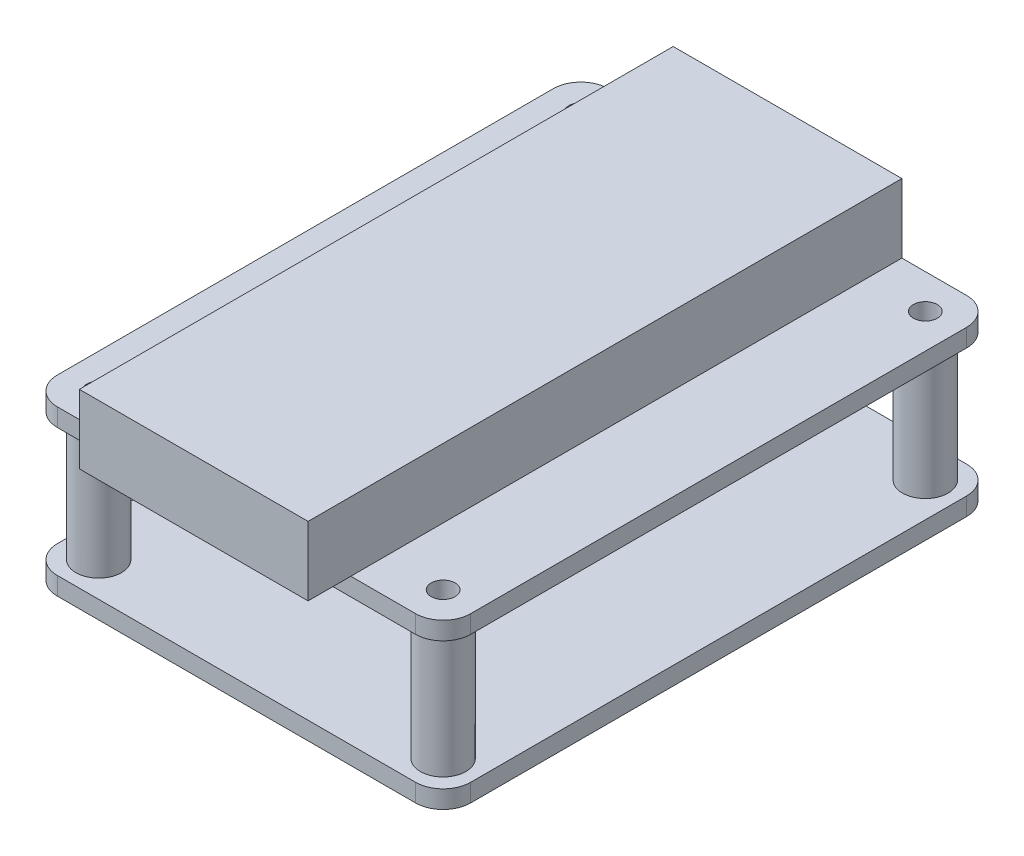
ISO-10303-21;
HEADER;
FILE_DESCRIPTION(('STEP AP214'),'2;1');
FILE_NAME('part.step','',(''),(''),'','','');
FILE_SCHEMA(('AUTOMOTIVE_DESIGN { 1 0 10303 214 1 1 1 1 }'));
ENDSEC;
DATA;
#1=APPLICATION_CONTEXT('core data for automotive mechanical design processes');
#2=APPLICATION_PROTOCOL_DEFINITION('international standard','automotive_design',2000,#1);
#3=PRODUCT_CONTEXT('',#1,'mechanical');
#4=PRODUCT('Part','Part','',(#3));
#5=PRODUCT_RELATED_PRODUCT_CATEGORY('part','',(#4));
#6=PRODUCT_DEFINITION_FORMATION('','',#4);
#7=PRODUCT_DEFINITION_CONTEXT('part definition',#1,'design');
#8=PRODUCT_DEFINITION('design','',#6,#7);
#9=PRODUCT_DEFINITION_SHAPE('','',#8);
#10=(LENGTH_UNIT() NAMED_UNIT(*) SI_UNIT(.MILLI.,.METRE.));
#11=(NAMED_UNIT(*) PLANE_ANGLE_UNIT() SI_UNIT($,.RADIAN.));
#12=(NAMED_UNIT(*) SI_UNIT($,.STERADIAN.) SOLID_ANGLE_UNIT());
#13=UNCERTAINTY_MEASURE_WITH_UNIT(LENGTH_MEASURE(1.E-05),#10,'distance_accuracy_value','');
#14=(GEOMETRIC_REPRESENTATION_CONTEXT(3) GLOBAL_UNCERTAINTY_ASSIGNED_CONTEXT((#13)) GLOBAL_UNIT_ASSIGNED_CONTEXT((#10,
#11,#12)) REPRESENTATION_CONTEXT('',''));
#15=CARTESIAN_POINT('',(0.,0.,0.));
#16=DIRECTION('',(0.,0.,1.));
#17=DIRECTION('',(1.,0.,0.));
#18=AXIS2_PLACEMENT_3D('',#15,#16,#17);
#19=CARTESIAN_POINT('',(-0.635000000000002,15.113,0.635000000000001));
#20=DIRECTION('',(0.,-1.,0.));
#21=DIRECTION('',(0.,0.,-1.));
#22=AXIS2_PLACEMENT_3D('',#19,#20,#21);
#23=PLANE('',#22);
#24=CARTESIAN_POINT('',(0.,15.113,0.));
#25=DIRECTION('',(0.,-1.,0.));
#26=DIRECTION('',(0.,0.,-1.));
#27=AXIS2_PLACEMENT_3D('',#24,#25,#26);
#28=CIRCLE('',#27,1.1);
#29=CARTESIAN_POINT('',(0.,15.113,-1.1));
#30=VERTEX_POINT('',#29);
#31=EDGE_CURVE('E232',#30,#30,#28,.T.);
#32=ORIENTED_EDGE('',*,*,#31,.T.);
#33=EDGE_LOOP('',(#32));
#34=FACE_BOUND('',#33,.T.);
#35=CARTESIAN_POINT('',(0.,15.113,-44.45));
#36=DIRECTION('',(0.,-1.,0.));
#37=DIRECTION('',(0.,0.,-1.));
#38=AXIS2_PLACEMENT_3D('',#35,#36,#37);
#39=CIRCLE('',#38,1.1);
#40=CARTESIAN_POINT('',(0.,15.113,-45.55));
#41=VERTEX_POINT('',#40);
#42=EDGE_CURVE('E238',#41,#41,#39,.T.);
#43=ORIENTED_EDGE('',*,*,#42,.T.);
#44=EDGE_LOOP('',(#43));
#45=FACE_BOUND('',#44,.T.);
#46=DIRECTION('',(0.,0.,1.));
#47=VECTOR('',#46,1.);
#48=CARTESIAN_POINT('',(5.334,15.113,-47.625));
#49=LINE('',#48,#47);
#50=CARTESIAN_POINT('',(5.334,15.113,-47.625));
#51=VERTEX_POINT('',#50);
#52=CARTESIAN_POINT('',(5.334,15.113,3.175));
#53=VERTEX_POINT('',#52);
#54=EDGE_CURVE('E66',#51,#53,#49,.T.);
#55=ORIENTED_EDGE('',*,*,#54,.F.);
#56=DIRECTION('',(1.,0.,0.));
#57=VECTOR('',#56,1.);
#58=CARTESIAN_POINT('',(-0.635000000000014,15.113,-47.625));
#59=LINE('',#58,#57);
#60=CARTESIAN_POINT('',(-0.635000000000014,15.113,-47.625));
#61=VERTEX_POINT('',#60);
#62=EDGE_CURVE('E271',#61,#51,#59,.T.);
#63=ORIENTED_EDGE('',*,*,#62,.F.);
#64=CARTESIAN_POINT('',(-0.635000000000013,15.113,-45.085));
#65=DIRECTION('',(0.,-1.,0.));
#66=DIRECTION('',(0.,0.,-1.));
#67=AXIS2_PLACEMENT_3D('',#64,#65,#66);
#68=CIRCLE('',#67,2.54);
#69=CARTESIAN_POINT('',(-3.17500000000001,15.113,-45.085));
#70=VERTEX_POINT('',#69);
#71=EDGE_CURVE('E268',#70,#61,#68,.T.);
#72=ORIENTED_EDGE('',*,*,#71,.F.);
#73=DIRECTION('',(0.,0.,-1.));
#74=VECTOR('',#73,1.);
#75=CARTESIAN_POINT('',(-3.175,15.113,0.635000000000001));
#76=LINE('',#75,#74);
#77=CARTESIAN_POINT('',(-3.175,15.113,0.635000000000001));
#78=VERTEX_POINT('',#77);
#79=EDGE_CURVE('E266',#78,#70,#76,.T.);
#80=ORIENTED_EDGE('',*,*,#79,.F.);
#81=CARTESIAN_POINT('',(-0.635000000000002,15.113,0.635000000000001));
#82=DIRECTION('',(0.,-1.,0.));
#83=DIRECTION('',(0.,0.,-1.));
#84=AXIS2_PLACEMENT_3D('',#81,#82,#83);
#85=CIRCLE('',#84,2.54);
#86=CARTESIAN_POINT('',(-0.635000000000002,15.113,3.175));
#87=VERTEX_POINT('',#86);
#88=EDGE_CURVE('E244',#87,#78,#85,.T.);
#89=ORIENTED_EDGE('',*,*,#88,.F.);
#90=DIRECTION('',(-1.,0.,0.));
#91=VECTOR('',#90,1.);
#92=CARTESIAN_POINT('',(32.385,15.113,3.17499999999998));
#93=LINE('',#92,#91);
#94=EDGE_CURVE('E71',#53,#87,#93,.T.);
#95=ORIENTED_EDGE('',*,*,#94,.F.);
#96=EDGE_LOOP('',(#55,#63,#72,#80,#89,#95));
#97=FACE_BOUND('',#96,.T.);
#98=ADVANCED_FACE('F49',(#34,#45,#97),#23,.F.);
#99=CARTESIAN_POINT('',(31.75,15.113,0.));
#100=DIRECTION('',(0.,-1.,0.));
#101=DIRECTION('',(0.,0.,-1.));
#102=AXIS2_PLACEMENT_3D('',#99,#100,#101);
#103=CIRCLE('',#102,1.1);
#104=CARTESIAN_POINT('',(31.75,15.113,-1.1));
#105=VERTEX_POINT('',#104);
#106=EDGE_CURVE('E235',#105,#105,#103,.T.);
#107=ORIENTED_EDGE('',*,*,#106,.T.);
#108=EDGE_LOOP('',(#107));
#109=FACE_BOUND('',#108,.T.);
#110=CARTESIAN_POINT('',(31.75,15.113,-44.45));
#111=DIRECTION('',(0.,-1.,0.));
#112=DIRECTION('',(0.,0.,-1.));
#113=AXIS2_PLACEMENT_3D('',#110,#111,#112);
#114=CIRCLE('',#113,1.09999999999999);
#115=CARTESIAN_POINT('',(31.75,15.113,-45.55));
#116=VERTEX_POINT('',#115);
#117=EDGE_CURVE('E241',#116,#116,#114,.T.);
#118=ORIENTED_EDGE('',*,*,#117,.T.);
#119=EDGE_LOOP('',(#118));
#120=FACE_BOUND('',#119,.T.);
#121=DIRECTION('',(0.,0.,-1.));
#122=VECTOR('',#121,1.);
#123=CARTESIAN_POINT('',(26.416,15.113,-47.625));
#124=LINE('',#123,#122);
#125=CARTESIAN_POINT('',(26.416,15.113,3.17499999999998));
#126=VERTEX_POINT('',#125);
#127=CARTESIAN_POINT('',(26.416,15.113,-47.625));
#128=VERTEX_POINT('',#127);
#129=EDGE_CURVE('E11',#126,#128,#124,.T.);
#130=ORIENTED_EDGE('',*,*,#129,.F.);
#131=CARTESIAN_POINT('',(32.385,15.113,3.17499999999998));
#132=VERTEX_POINT('',#131);
#133=EDGE_CURVE('E249',#132,#126,#93,.T.);
#134=ORIENTED_EDGE('',*,*,#133,.F.);
#135=CARTESIAN_POINT('',(32.385,15.113,0.634999999999983));
#136=DIRECTION('',(0.,-1.,0.));
#137=DIRECTION('',(0.,0.,-1.));
#138=AXIS2_PLACEMENT_3D('',#135,#136,#137);
#139=CIRCLE('',#138,2.53999999999999);
#140=CARTESIAN_POINT('',(34.925,15.113,0.635000000000002));
#141=VERTEX_POINT('',#140);
#142=EDGE_CURVE('E277',#141,#132,#139,.T.);
#143=ORIENTED_EDGE('',*,*,#142,.F.);
#144=DIRECTION('',(0.,0.,1.));
#145=VECTOR('',#144,1.);
#146=CARTESIAN_POINT('',(34.925,15.113,-45.085));
#147=LINE('',#146,#145);
#148=CARTESIAN_POINT('',(34.925,15.113,-45.085));
#149=VERTEX_POINT('',#148);
#150=EDGE_CURVE('E275',#149,#141,#147,.T.);
#151=ORIENTED_EDGE('',*,*,#150,.F.);
#152=CARTESIAN_POINT('',(32.385,15.113,-45.085));
#153=DIRECTION('',(0.,-1.,0.));
#154=DIRECTION('',(0.,0.,-1.));
#155=AXIS2_PLACEMENT_3D('',#152,#153,#154);
#156=CIRCLE('',#155,2.53999999999999);
#157=CARTESIAN_POINT('',(32.385,15.113,-47.625));
#158=VERTEX_POINT('',#157);
#159=EDGE_CURVE('E273',#158,#149,#156,.T.);
#160=ORIENTED_EDGE('',*,*,#159,.F.);
#161=EDGE_CURVE('E270',#128,#158,#59,.T.);
#162=ORIENTED_EDGE('',*,*,#161,.F.);
#163=EDGE_LOOP('',(#130,#134,#143,#151,#160,#162));
#164=FACE_BOUND('',#163,.T.);
#165=ADVANCED_FACE('F395',(#109,#120,#164),#23,.F.);
#166=CARTESIAN_POINT('',(-0.635000000000002,1.651,0.635000000000001));
#167=DIRECTION('',(0.,-1.,0.));
#168=DIRECTION('',(0.,0.,-1.));
#169=AXIS2_PLACEMENT_3D('',#166,#167,#168);
#170=PLANE('',#169);
#171=CARTESIAN_POINT('',(31.75,1.651,-44.45));
#172=DIRECTION('',(0.,-1.,0.));
#173=DIRECTION('',(0.,0.,-1.));
#174=AXIS2_PLACEMENT_3D('',#171,#172,#173);
#175=CIRCLE('',#174,2.1);
#176=CARTESIAN_POINT('',(31.75,1.651,-46.55));
#177=VERTEX_POINT('',#176);
#178=EDGE_CURVE('E383',#177,#177,#175,.F.);
#179=ORIENTED_EDGE('',*,*,#178,.F.);
#180=EDGE_LOOP('',(#179));
#181=FACE_BOUND('',#180,.T.);
#182=CARTESIAN_POINT('',(-0.635000000000002,1.651,0.635000000000001));
#183=DIRECTION('',(0.,1.,0.));
#184=DIRECTION('',(0.,0.,-1.));
#185=AXIS2_PLACEMENT_3D('',#182,#183,#184);
#186=CIRCLE('',#185,2.54);
#187=CARTESIAN_POINT('',(-3.175,1.651,0.635000000000001));
#188=VERTEX_POINT('',#187);
#189=CARTESIAN_POINT('',(-0.635000000000002,1.651,3.175));
#190=VERTEX_POINT('',#189);
#191=EDGE_CURVE('E326',#188,#190,#186,.T.);
#192=ORIENTED_EDGE('',*,*,#191,.T.);
#193=DIRECTION('',(1.,0.,0.));
#194=VECTOR('',#193,1.);
#195=CARTESIAN_POINT('',(-0.635000000000002,1.651,3.175));
#196=LINE('',#195,#194);
#197=CARTESIAN_POINT('',(32.385,1.651,3.17499999999998));
#198=VERTEX_POINT('',#197);
#199=EDGE_CURVE('E329',#190,#198,#196,.T.);
#200=ORIENTED_EDGE('',*,*,#199,.T.);
#201=CARTESIAN_POINT('',(32.385,1.651,0.634999999999983));
#202=DIRECTION('',(0.,1.,0.));
#203=DIRECTION('',(0.,0.,1.));
#204=AXIS2_PLACEMENT_3D('',#201,#202,#203);
#205=CIRCLE('',#204,2.53999999999999);
#206=CARTESIAN_POINT('',(34.925,1.651,0.635000000000002));
#207=VERTEX_POINT('',#206);
#208=EDGE_CURVE('E332',#198,#207,#205,.T.);
#209=ORIENTED_EDGE('',*,*,#208,.T.);
#210=DIRECTION('',(0.,0.,-1.));
#211=VECTOR('',#210,1.);
#212=CARTESIAN_POINT('',(34.925,1.651,0.635000000000001));
#213=LINE('',#212,#211);
#214=CARTESIAN_POINT('',(34.925,1.651,-45.085));
#215=VERTEX_POINT('',#214);
#216=EDGE_CURVE('E334',#207,#215,#213,.T.);
#217=ORIENTED_EDGE('',*,*,#216,.T.);
#218=CARTESIAN_POINT('',(32.385,1.651,-45.085));
#219=DIRECTION('',(0.,1.,0.));
#220=DIRECTION('',(0.,0.,-1.));
#221=AXIS2_PLACEMENT_3D('',#218,#219,#220);
#222=CIRCLE('',#221,2.54);
#223=CARTESIAN_POINT('',(32.385,1.651,-47.625));
#224=VERTEX_POINT('',#223);
#225=EDGE_CURVE('E336',#215,#224,#222,.T.);
#226=ORIENTED_EDGE('',*,*,#225,.T.);
#227=DIRECTION('',(-1.,0.,0.));
#228=VECTOR('',#227,1.);
#229=CARTESIAN_POINT('',(-0.635000000000014,1.651,-47.625));
#230=LINE('',#229,#228);
#231=CARTESIAN_POINT('',(-0.635000000000014,1.651,-47.625));
#232=VERTEX_POINT('',#231);
#233=EDGE_CURVE('E338',#224,#232,#230,.T.);
#234=ORIENTED_EDGE('',*,*,#233,.T.);
#235=CARTESIAN_POINT('',(-0.635000000000013,1.651,-45.085));
#236=DIRECTION('',(0.,1.,0.));
#237=DIRECTION('',(0.,0.,-1.));
#238=AXIS2_PLACEMENT_3D('',#235,#236,#237);
#239=CIRCLE('',#238,2.54);
#240=CARTESIAN_POINT('',(-3.17500000000001,1.651,-45.085));
#241=VERTEX_POINT('',#240);
#242=EDGE_CURVE('E340',#232,#241,#239,.T.);
#243=ORIENTED_EDGE('',*,*,#242,.T.);
#244=DIRECTION('',(0.,0.,1.));
#245=VECTOR('',#244,1.);
#246=CARTESIAN_POINT('',(-3.175,1.651,0.635000000000001));
#247=LINE('',#246,#245);
#248=EDGE_CURVE('E342',#241,#188,#247,.T.);
#249=ORIENTED_EDGE('',*,*,#248,.T.);
#250=EDGE_LOOP('',(#192,#200,#209,#217,#226,#234,#243,#249));
#251=FACE_BOUND('',#250,.T.);
#252=CARTESIAN_POINT('',(0.,1.651,0.));
#253=DIRECTION('',(0.,1.,0.));
#254=DIRECTION('',(0.,0.,1.));
#255=AXIS2_PLACEMENT_3D('',#252,#253,#254);
#256=CIRCLE('',#255,2.1);
#257=CARTESIAN_POINT('',(0.,1.651,2.1));
#258=VERTEX_POINT('',#257);
#259=EDGE_CURVE('E306',#258,#258,#256,.T.);
#260=ORIENTED_EDGE('',*,*,#259,.F.);
#261=EDGE_LOOP('',(#260));
#262=FACE_BOUND('',#261,.T.);
#263=CARTESIAN_POINT('',(31.75,1.651,0.));
#264=DIRECTION('',(0.,-1.,0.));
#265=DIRECTION('',(0.,0.,-1.));
#266=AXIS2_PLACEMENT_3D('',#263,#264,#265);
#267=CIRCLE('',#266,2.1);
#268=CARTESIAN_POINT('',(31.75,1.651,-2.1));
#269=VERTEX_POINT('',#268);
#270=EDGE_CURVE('E309',#269,#269,#267,.F.);
#271=ORIENTED_EDGE('',*,*,#270,.F.);
#272=EDGE_LOOP('',(#271));
#273=FACE_BOUND('',#272,.T.);
#274=CARTESIAN_POINT('',(0.,1.651,-44.45));
#275=DIRECTION('',(0.,-1.,0.));
#276=DIRECTION('',(0.,0.,-1.));
#277=AXIS2_PLACEMENT_3D('',#274,#275,#276);
#278=CIRCLE('',#277,2.1);
#279=CARTESIAN_POINT('',(0.,1.651,-46.55));
#280=VERTEX_POINT('',#279);
#281=EDGE_CURVE('E53',#280,#280,#278,.F.);
#282=ORIENTED_EDGE('',*,*,#281,.F.);
#283=EDGE_LOOP('',(#282));
#284=FACE_BOUND('',#283,.T.);
#285=ADVANCED_FACE('F392',(#181,#251,#262,#273,#284),#170,.F.);
#286=CARTESIAN_POINT('',(-0.635000000000002,13.462,0.635000000000001));
#287=DIRECTION('',(0.,-1.,0.));
#288=DIRECTION('',(0.,0.,-1.));
#289=AXIS2_PLACEMENT_3D('',#286,#287,#288);
#290=PLANE('',#289);
#291=CARTESIAN_POINT('',(31.75,13.462,-44.45));
#292=DIRECTION('',(0.,-1.,0.));
#293=DIRECTION('',(0.,0.,-1.));
#294=AXIS2_PLACEMENT_3D('',#291,#292,#293);
#295=CIRCLE('',#294,2.1);
#296=CARTESIAN_POINT('',(31.75,13.462,-46.55));
#297=VERTEX_POINT('',#296);
#298=EDGE_CURVE('E221',#297,#297,#295,.T.);
#299=ORIENTED_EDGE('',*,*,#298,.F.);
#300=EDGE_LOOP('',(#299));
#301=FACE_BOUND('',#300,.T.);
#302=CARTESIAN_POINT('',(-0.635000000000002,13.462,0.635000000000001));
#303=DIRECTION('',(0.,-1.,0.));
#304=DIRECTION('',(0.,0.,-1.));
#305=AXIS2_PLACEMENT_3D('',#302,#303,#304);
#306=CIRCLE('',#305,2.54);
#307=CARTESIAN_POINT('',(-0.635000000000002,13.462,3.175));
#308=VERTEX_POINT('',#307);
#309=CARTESIAN_POINT('',(-3.175,13.462,0.635000000000001));
#310=VERTEX_POINT('',#309);
#311=EDGE_CURVE('E245',#308,#310,#306,.T.);
#312=ORIENTED_EDGE('',*,*,#311,.T.);
#313=DIRECTION('',(0.,0.,-1.));
#314=VECTOR('',#313,1.);
#315=CARTESIAN_POINT('',(-3.175,13.462,0.635000000000001));
#316=LINE('',#315,#314);
#317=CARTESIAN_POINT('',(-3.17500000000001,13.462,-45.085));
#318=VERTEX_POINT('',#317);
#319=EDGE_CURVE('E248',#310,#318,#316,.T.);
#320=ORIENTED_EDGE('',*,*,#319,.T.);
#321=CARTESIAN_POINT('',(-0.635000000000013,13.462,-45.085));
#322=DIRECTION('',(0.,-1.,0.));
#323=DIRECTION('',(0.,0.,-1.));
#324=AXIS2_PLACEMENT_3D('',#321,#322,#323);
#325=CIRCLE('',#324,2.54);
#326=CARTESIAN_POINT('',(-0.635000000000014,13.462,-47.625));
#327=VERTEX_POINT('',#326);
#328=EDGE_CURVE('E251',#318,#327,#325,.T.);
#329=ORIENTED_EDGE('',*,*,#328,.T.);
#330=DIRECTION('',(1.,0.,0.));
#331=VECTOR('',#330,1.);
#332=CARTESIAN_POINT('',(-0.635000000000014,13.462,-47.625));
#333=LINE('',#332,#331);
#334=CARTESIAN_POINT('',(32.385,13.462,-47.625));
#335=VERTEX_POINT('',#334);
#336=EDGE_CURVE('E253',#327,#335,#333,.T.);
#337=ORIENTED_EDGE('',*,*,#336,.T.);
#338=CARTESIAN_POINT('',(32.385,13.462,-45.085));
#339=DIRECTION('',(0.,-1.,0.));
#340=DIRECTION('',(0.,0.,-1.));
#341=AXIS2_PLACEMENT_3D('',#338,#339,#340);
#342=CIRCLE('',#341,2.53999999999999);
#343=CARTESIAN_POINT('',(34.925,13.462,-45.085));
#344=VERTEX_POINT('',#343);
#345=EDGE_CURVE('E255',#335,#344,#342,.T.);
#346=ORIENTED_EDGE('',*,*,#345,.T.);
#347=DIRECTION('',(0.,0.,1.));
#348=VECTOR('',#347,1.);
#349=CARTESIAN_POINT('',(34.925,13.462,-45.085));
#350=LINE('',#349,#348);
#351=CARTESIAN_POINT('',(34.925,13.462,0.635000000000002));
#352=VERTEX_POINT('',#351);
#353=EDGE_CURVE('E257',#344,#352,#350,.T.);
#354=ORIENTED_EDGE('',*,*,#353,.T.);
#355=CARTESIAN_POINT('',(32.385,13.462,0.634999999999983));
#356=DIRECTION('',(0.,-1.,0.));
#357=DIRECTION('',(0.,0.,-1.));
#358=AXIS2_PLACEMENT_3D('',#355,#356,#357);
#359=CIRCLE('',#358,2.53999999999999);
#360=CARTESIAN_POINT('',(32.385,13.462,3.17499999999998));
#361=VERTEX_POINT('',#360);
#362=EDGE_CURVE('E259',#352,#361,#359,.T.);
#363=ORIENTED_EDGE('',*,*,#362,.T.);
#364=DIRECTION('',(-1.,0.,0.));
#365=VECTOR('',#364,1.);
#366=CARTESIAN_POINT('',(32.385,13.462,3.17499999999998));
#367=LINE('',#366,#365);
#368=EDGE_CURVE('E261',#361,#308,#367,.T.);
#369=ORIENTED_EDGE('',*,*,#368,.T.);
#370=EDGE_LOOP('',(#312,#320,#329,#337,#346,#354,#363,#369));
#371=FACE_BOUND('',#370,.T.);
#372=CARTESIAN_POINT('',(0.,13.462,0.));
#373=DIRECTION('',(0.,-1.,0.));
#374=DIRECTION('',(0.,0.,-1.));
#375=AXIS2_PLACEMENT_3D('',#372,#373,#374);
#376=CIRCLE('',#375,2.1);
#377=CARTESIAN_POINT('',(0.,13.462,-2.1));
#378=VERTEX_POINT('',#377);
#379=EDGE_CURVE('E305',#378,#378,#376,.T.);
#380=ORIENTED_EDGE('',*,*,#379,.F.);
#381=EDGE_LOOP('',(#380));
#382=FACE_BOUND('',#381,.T.);
#383=CARTESIAN_POINT('',(31.75,13.462,0.));
#384=DIRECTION('',(0.,-1.,0.));
#385=DIRECTION('',(0.,0.,-1.));
#386=AXIS2_PLACEMENT_3D('',#383,#384,#385);
#387=CIRCLE('',#386,2.1);
#388=CARTESIAN_POINT('',(31.75,13.462,-2.1));
#389=VERTEX_POINT('',#388);
#390=EDGE_CURVE('E229',#389,#389,#387,.T.);
#391=ORIENTED_EDGE('',*,*,#390,.F.);
#392=EDGE_LOOP('',(#391));
#393=FACE_BOUND('',#392,.T.);
#394=CARTESIAN_POINT('',(0.,13.462,-44.45));
#395=DIRECTION('',(0.,-1.,0.));
#396=DIRECTION('',(0.,0.,-1.));
#397=AXIS2_PLACEMENT_3D('',#394,#395,#396);
#398=CIRCLE('',#397,2.1);
#399=CARTESIAN_POINT('',(0.,13.462,-46.55));
#400=VERTEX_POINT('',#399);
#401=EDGE_CURVE('E218',#400,#400,#398,.T.);
#402=ORIENTED_EDGE('',*,*,#401,.F.);
#403=EDGE_LOOP('',(#402));
#404=FACE_BOUND('',#403,.T.);
#405=ADVANCED_FACE('F394',(#301,#371,#382,#393,#404),#290,.T.);
#406=CARTESIAN_POINT('',(-0.635000000000002,0.,0.635000000000001));
#407=DIRECTION('',(0.,-1.,0.));
#408=DIRECTION('',(0.,0.,-1.));
#409=AXIS2_PLACEMENT_3D('',#406,#407,#408);
#410=PLANE('',#409);
#411=CARTESIAN_POINT('',(31.75,0.,0.));
#412=DIRECTION('',(0.,1.,0.));
#413=DIRECTION('',(0.,0.,1.));
#414=AXIS2_PLACEMENT_3D('',#411,#412,#413);
#415=CIRCLE('',#414,1.1);
#416=CARTESIAN_POINT('',(31.75,0.,1.1));
#417=VERTEX_POINT('',#416);
#418=EDGE_CURVE('E316',#417,#417,#415,.T.);
#419=ORIENTED_EDGE('',*,*,#418,.T.);
#420=EDGE_LOOP('',(#419));
#421=FACE_BOUND('',#420,.T.);
#422=CARTESIAN_POINT('',(31.75,0.,-44.45));
#423=DIRECTION('',(0.,1.,0.));
#424=DIRECTION('',(0.,0.,1.));
#425=AXIS2_PLACEMENT_3D('',#422,#423,#424);
#426=CIRCLE('',#425,1.1);
#427=CARTESIAN_POINT('',(31.75,0.,-43.35));
#428=VERTEX_POINT('',#427);
#429=EDGE_CURVE('E322',#428,#428,#426,.T.);
#430=ORIENTED_EDGE('',*,*,#429,.T.);
#431=EDGE_LOOP('',(#430));
#432=FACE_BOUND('',#431,.T.);
#433=CARTESIAN_POINT('',(-0.635000000000002,0.,0.635000000000001));
#434=DIRECTION('',(0.,1.,0.));
#435=DIRECTION('',(0.,0.,-1.));
#436=AXIS2_PLACEMENT_3D('',#433,#434,#435);
#437=CIRCLE('',#436,2.54);
#438=CARTESIAN_POINT('',(-3.175,0.,0.635000000000001));
#439=VERTEX_POINT('',#438);
#440=CARTESIAN_POINT('',(-0.635000000000002,0.,3.175));
#441=VERTEX_POINT('',#440);
#442=EDGE_CURVE('E325',#439,#441,#437,.T.);
#443=ORIENTED_EDGE('',*,*,#442,.F.);
#444=DIRECTION('',(0.,0.,1.));
#445=VECTOR('',#444,1.);
#446=CARTESIAN_POINT('',(-3.175,0.,0.635000000000001));
#447=LINE('',#446,#445);
#448=CARTESIAN_POINT('',(-3.17500000000001,0.,-45.085));
#449=VERTEX_POINT('',#448);
#450=EDGE_CURVE('E330',#449,#439,#447,.T.);
#451=ORIENTED_EDGE('',*,*,#450,.F.);
#452=CARTESIAN_POINT('',(-0.635000000000013,0.,-45.085));
#453=DIRECTION('',(0.,1.,0.));
#454=DIRECTION('',(0.,0.,-1.));
#455=AXIS2_PLACEMENT_3D('',#452,#453,#454);
#456=CIRCLE('',#455,2.54);
#457=CARTESIAN_POINT('',(-0.635000000000014,0.,-47.625));
#458=VERTEX_POINT('',#457);
#459=EDGE_CURVE('E357',#458,#449,#456,.T.);
#460=ORIENTED_EDGE('',*,*,#459,.F.);
#461=DIRECTION('',(-1.,0.,0.));
#462=VECTOR('',#461,1.);
#463=CARTESIAN_POINT('',(-0.635000000000014,0.,-47.625));
#464=LINE('',#463,#462);
#465=CARTESIAN_POINT('',(32.385,0.,-47.625));
#466=VERTEX_POINT('',#465);
#467=EDGE_CURVE('E355',#466,#458,#464,.T.);
#468=ORIENTED_EDGE('',*,*,#467,.F.);
#469=CARTESIAN_POINT('',(32.385,0.,-45.085));
#470=DIRECTION('',(0.,1.,0.));
#471=DIRECTION('',(0.,0.,-1.));
#472=AXIS2_PLACEMENT_3D('',#469,#470,#471);
#473=CIRCLE('',#472,2.54);
#474=CARTESIAN_POINT('',(34.925,0.,-45.085));
#475=VERTEX_POINT('',#474);
#476=EDGE_CURVE('E353',#475,#466,#473,.T.);
#477=ORIENTED_EDGE('',*,*,#476,.F.);
#478=DIRECTION('',(0.,0.,-1.));
#479=VECTOR('',#478,1.);
#480=CARTESIAN_POINT('',(34.925,0.,0.635000000000001));
#481=LINE('',#480,#479);
#482=CARTESIAN_POINT('',(34.925,0.,0.635000000000002));
#483=VERTEX_POINT('',#482);
#484=EDGE_CURVE('E351',#483,#475,#481,.T.);
#485=ORIENTED_EDGE('',*,*,#484,.F.);
#486=CARTESIAN_POINT('',(32.385,0.,0.634999999999983));
#487=DIRECTION('',(0.,1.,0.));
#488=DIRECTION('',(0.,0.,1.));
#489=AXIS2_PLACEMENT_3D('',#486,#487,#488);
#490=CIRCLE('',#489,2.53999999999999);
#491=CARTESIAN_POINT('',(32.385,0.,3.17499999999998));
#492=VERTEX_POINT('',#491);
#493=EDGE_CURVE('E349',#492,#483,#490,.T.);
#494=ORIENTED_EDGE('',*,*,#493,.F.);
#495=DIRECTION('',(1.,0.,0.));
#496=VECTOR('',#495,1.);
#497=CARTESIAN_POINT('',(-0.635000000000002,0.,3.175));
#498=LINE('',#497,#496);
#499=EDGE_CURVE('E347',#441,#492,#498,.T.);
#500=ORIENTED_EDGE('',*,*,#499,.F.);
#501=EDGE_LOOP('',(#443,#451,#460,#468,#477,#485,#494,#500));
#502=FACE_BOUND('',#501,.T.);
#503=CARTESIAN_POINT('',(0.,0.,-44.45));
#504=DIRECTION('',(0.,1.,0.));
#505=DIRECTION('',(0.,0.,1.));
#506=AXIS2_PLACEMENT_3D('',#503,#504,#505);
#507=CIRCLE('',#506,1.1);
#508=CARTESIAN_POINT('',(0.,0.,-43.35));
#509=VERTEX_POINT('',#508);
#510=EDGE_CURVE('E319',#509,#509,#507,.T.);
#511=ORIENTED_EDGE('',*,*,#510,.T.);
#512=EDGE_LOOP('',(#511));
#513=FACE_BOUND('',#512,.T.);
#514=CARTESIAN_POINT('',(0.,0.,0.));
#515=DIRECTION('',(0.,1.,0.));
#516=DIRECTION('',(0.,0.,1.));
#517=AXIS2_PLACEMENT_3D('',#514,#515,#516);
#518=CIRCLE('',#517,1.1);
#519=CARTESIAN_POINT('',(0.,0.,1.1));
#520=VERTEX_POINT('',#519);
#521=EDGE_CURVE('E313',#520,#520,#518,.T.);
#522=ORIENTED_EDGE('',*,*,#521,.T.);
#523=EDGE_LOOP('',(#522));
#524=FACE_BOUND('',#523,.T.);
#525=ADVANCED_FACE('F402',(#421,#432,#502,#513,#524),#410,.T.);
#526=CARTESIAN_POINT('',(-0.635000000000002,1.651,0.635000000000001));
#527=DIRECTION('',(0.,-1.,0.));
#528=DIRECTION('',(0.,0.,-1.));
#529=AXIS2_PLACEMENT_3D('',#526,#527,#528);
#530=CYLINDRICAL_SURFACE('',#529,2.54);
#531=ORIENTED_EDGE('',*,*,#442,.T.);
#532=DIRECTION('',(0.,-1.,0.));
#533=VECTOR('',#532,1.);
#534=CARTESIAN_POINT('',(-0.635000000000002,1.651,3.175));
#535=LINE('',#534,#533);
#536=EDGE_CURVE('E310',#190,#441,#535,.T.);
#537=ORIENTED_EDGE('',*,*,#536,.F.);
#538=ORIENTED_EDGE('',*,*,#191,.F.);
#539=DIRECTION('',(0.,-1.,0.));
#540=VECTOR('',#539,1.);
#541=CARTESIAN_POINT('',(-3.175,1.651,0.635000000000001));
#542=LINE('',#541,#540);
#543=EDGE_CURVE('E344',#188,#439,#542,.T.);
#544=ORIENTED_EDGE('',*,*,#543,.T.);
#545=EDGE_LOOP('',(#531,#537,#538,#544));
#546=FACE_BOUND('',#545,.T.);
#547=ADVANCED_FACE('F51',(#546),#530,.T.);
#548=CARTESIAN_POINT('',(-0.635000000000002,1.651,3.175));
#549=DIRECTION('',(0.,0.,-1.));
#550=DIRECTION('',(-1.,0.,0.));
#551=AXIS2_PLACEMENT_3D('',#548,#549,#550);
#552=PLANE('',#551);
#553=ORIENTED_EDGE('',*,*,#499,.T.);
#554=DIRECTION('',(0.,-1.,0.));
#555=VECTOR('',#554,1.);
#556=CARTESIAN_POINT('',(32.385,1.651,3.17499999999998));
#557=LINE('',#556,#555);
#558=EDGE_CURVE('E377',#198,#492,#557,.T.);
#559=ORIENTED_EDGE('',*,*,#558,.F.);
#560=ORIENTED_EDGE('',*,*,#199,.F.);
#561=ORIENTED_EDGE('',*,*,#536,.T.);
#562=EDGE_LOOP('',(#553,#559,#560,#561));
#563=FACE_BOUND('',#562,.T.);
#564=ADVANCED_FACE('F847',(#563),#552,.F.);
#565=CARTESIAN_POINT('',(32.385,1.651,0.634999999999983));
#566=DIRECTION('',(0.,-1.,0.));
#567=DIRECTION('',(0.,0.,-1.));
#568=AXIS2_PLACEMENT_3D('',#565,#566,#567);
#569=CYLINDRICAL_SURFACE('',#568,2.53999999999999);
#570=ORIENTED_EDGE('',*,*,#493,.T.);
#571=DIRECTION('',(0.,-1.,0.));
#572=VECTOR('',#571,1.);
#573=CARTESIAN_POINT('',(34.925,1.651,0.635000000000002));
#574=LINE('',#573,#572);
#575=EDGE_CURVE('E374',#207,#483,#574,.T.);
#576=ORIENTED_EDGE('',*,*,#575,.F.);
#577=ORIENTED_EDGE('',*,*,#208,.F.);
#578=ORIENTED_EDGE('',*,*,#558,.T.);
#579=EDGE_LOOP('',(#570,#576,#577,#578));
#580=FACE_BOUND('',#579,.T.);
#581=ADVANCED_FACE('F834',(#580),#569,.T.);
#582=CARTESIAN_POINT('',(34.925,1.651,0.635000000000001));
#583=DIRECTION('',(-1.,0.,0.));
#584=DIRECTION('',(0.,0.,1.));
#585=AXIS2_PLACEMENT_3D('',#582,#583,#584);
#586=PLANE('',#585);
#587=ORIENTED_EDGE('',*,*,#484,.T.);
#588=DIRECTION('',(0.,-1.,0.));
#589=VECTOR('',#588,1.);
#590=CARTESIAN_POINT('',(34.925,1.651,-45.085));
#591=LINE('',#590,#589);
#592=EDGE_CURVE('E371',#215,#475,#591,.T.);
#593=ORIENTED_EDGE('',*,*,#592,.F.);
#594=ORIENTED_EDGE('',*,*,#216,.F.);
#595=ORIENTED_EDGE('',*,*,#575,.T.);
#596=EDGE_LOOP('',(#587,#593,#594,#595));
#597=FACE_BOUND('',#596,.T.);
#598=ADVANCED_FACE('F821',(#597),#586,.F.);
#599=CARTESIAN_POINT('',(32.385,1.651,-45.085));
#600=DIRECTION('',(0.,-1.,0.));
#601=DIRECTION('',(0.,0.,-1.));
#602=AXIS2_PLACEMENT_3D('',#599,#600,#601);
#603=CYLINDRICAL_SURFACE('',#602,2.54);
#604=ORIENTED_EDGE('',*,*,#476,.T.);
#605=DIRECTION('',(0.,-1.,0.));
#606=VECTOR('',#605,1.);
#607=CARTESIAN_POINT('',(32.385,1.651,-47.625));
#608=LINE('',#607,#606);
#609=EDGE_CURVE('E368',#224,#466,#608,.T.);
#610=ORIENTED_EDGE('',*,*,#609,.F.);
#611=ORIENTED_EDGE('',*,*,#225,.F.);
#612=ORIENTED_EDGE('',*,*,#592,.T.);
#613=EDGE_LOOP('',(#604,#610,#611,#612));
#614=FACE_BOUND('',#613,.T.);
#615=ADVANCED_FACE('F809',(#614),#603,.T.);
#616=CARTESIAN_POINT('',(-0.635000000000014,1.651,-47.625));
#617=DIRECTION('',(0.,0.,1.));
#618=DIRECTION('',(1.,0.,0.));
#619=AXIS2_PLACEMENT_3D('',#616,#617,#618);
#620=PLANE('',#619);
#621=ORIENTED_EDGE('',*,*,#467,.T.);
#622=DIRECTION('',(0.,-1.,0.));
#623=VECTOR('',#622,1.);
#624=CARTESIAN_POINT('',(-0.635000000000014,1.651,-47.625));
#625=LINE('',#624,#623);
#626=EDGE_CURVE('E365',#232,#458,#625,.T.);
#627=ORIENTED_EDGE('',*,*,#626,.F.);
#628=ORIENTED_EDGE('',*,*,#233,.F.);
#629=ORIENTED_EDGE('',*,*,#609,.T.);
#630=EDGE_LOOP('',(#621,#627,#628,#629));
#631=FACE_BOUND('',#630,.T.);
#632=ADVANCED_FACE('F796',(#631),#620,.F.);
#633=CARTESIAN_POINT('',(-0.635000000000013,1.651,-45.085));
#634=DIRECTION('',(0.,-1.,0.));
#635=DIRECTION('',(0.,0.,-1.));
#636=AXIS2_PLACEMENT_3D('',#633,#634,#635);
#637=CYLINDRICAL_SURFACE('',#636,2.54);
#638=ORIENTED_EDGE('',*,*,#459,.T.);
#639=DIRECTION('',(0.,-1.,0.));
#640=VECTOR('',#639,1.);
#641=CARTESIAN_POINT('',(-3.17500000000001,1.651,-45.085));
#642=LINE('',#641,#640);
#643=EDGE_CURVE('E362',#241,#449,#642,.T.);
#644=ORIENTED_EDGE('',*,*,#643,.F.);
#645=ORIENTED_EDGE('',*,*,#242,.F.);
#646=ORIENTED_EDGE('',*,*,#626,.T.);
#647=EDGE_LOOP('',(#638,#644,#645,#646));
#648=FACE_BOUND('',#647,.T.);
#649=ADVANCED_FACE('F472',(#648),#637,.T.);
#650=CARTESIAN_POINT('',(-3.175,1.651,0.635000000000001));
#651=DIRECTION('',(1.,0.,0.));
#652=DIRECTION('',(0.,0.,-1.));
#653=AXIS2_PLACEMENT_3D('',#650,#651,#652);
#654=PLANE('',#653);
#655=ORIENTED_EDGE('',*,*,#450,.T.);
#656=ORIENTED_EDGE('',*,*,#543,.F.);
#657=ORIENTED_EDGE('',*,*,#248,.F.);
#658=ORIENTED_EDGE('',*,*,#643,.T.);
#659=EDGE_LOOP('',(#655,#656,#657,#658));
#660=FACE_BOUND('',#659,.T.);
#661=ADVANCED_FACE('F467',(#660),#654,.F.);
#662=CARTESIAN_POINT('',(31.75,1.651,-44.45));
#663=DIRECTION('',(0.,-1.,0.));
#664=DIRECTION('',(0.,0.,-1.));
#665=AXIS2_PLACEMENT_3D('',#662,#663,#664);
#666=CYLINDRICAL_SURFACE('',#665,1.1);
#667=ORIENTED_EDGE('',*,*,#429,.F.);
#668=EDGE_LOOP('',(#667));
#669=FACE_BOUND('',#668,.T.);
#670=ORIENTED_EDGE('',*,*,#117,.F.);
#671=EDGE_LOOP('',(#670));
#672=FACE_BOUND('',#671,.T.);
#673=ADVANCED_FACE('F464',(#669,#672),#666,.F.);
#674=CARTESIAN_POINT('',(0.,1.651,-44.45));
#675=DIRECTION('',(0.,-1.,0.));
#676=DIRECTION('',(0.,0.,-1.));
#677=AXIS2_PLACEMENT_3D('',#674,#675,#676);
#678=CYLINDRICAL_SURFACE('',#677,1.1);
#679=ORIENTED_EDGE('',*,*,#510,.F.);
#680=EDGE_LOOP('',(#679));
#681=FACE_BOUND('',#680,.T.);
#682=ORIENTED_EDGE('',*,*,#42,.F.);
#683=EDGE_LOOP('',(#682));
#684=FACE_BOUND('',#683,.T.);
#685=ADVANCED_FACE('F461',(#681,#684),#678,.F.);
#686=CARTESIAN_POINT('',(31.75,1.651,0.));
#687=DIRECTION('',(0.,-1.,0.));
#688=DIRECTION('',(0.,0.,-1.));
#689=AXIS2_PLACEMENT_3D('',#686,#687,#688);
#690=CYLINDRICAL_SURFACE('',#689,1.1);
#691=ORIENTED_EDGE('',*,*,#418,.F.);
#692=EDGE_LOOP('',(#691));
#693=FACE_BOUND('',#692,.T.);
#694=ORIENTED_EDGE('',*,*,#106,.F.);
#695=EDGE_LOOP('',(#694));
#696=FACE_BOUND('',#695,.T.);
#697=ADVANCED_FACE('F457',(#693,#696),#690,.F.);
#698=CARTESIAN_POINT('',(0.,1.651,0.));
#699=DIRECTION('',(0.,-1.,0.));
#700=DIRECTION('',(0.,0.,-1.));
#701=AXIS2_PLACEMENT_3D('',#698,#699,#700);
#702=CYLINDRICAL_SURFACE('',#701,1.1);
#703=ORIENTED_EDGE('',*,*,#521,.F.);
#704=EDGE_LOOP('',(#703));
#705=FACE_BOUND('',#704,.T.);
#706=ORIENTED_EDGE('',*,*,#31,.F.);
#707=EDGE_LOOP('',(#706));
#708=FACE_BOUND('',#707,.T.);
#709=ADVANCED_FACE('F453',(#705,#708),#702,.F.);
#710=CARTESIAN_POINT('',(0.,19.401696961967,0.));
#711=DIRECTION('',(0.,-1.,0.));
#712=DIRECTION('',(0.,0.,-1.));
#713=AXIS2_PLACEMENT_3D('',#710,#711,#712);
#714=CYLINDRICAL_SURFACE('',#713,2.1);
#715=ORIENTED_EDGE('',*,*,#379,.T.);
#716=EDGE_LOOP('',(#715));
#717=FACE_BOUND('',#716,.T.);
#718=ORIENTED_EDGE('',*,*,#259,.T.);
#719=EDGE_LOOP('',(#718));
#720=FACE_BOUND('',#719,.T.);
#721=ADVANCED_FACE('F449',(#717,#720),#714,.T.);
#722=CARTESIAN_POINT('',(-0.635000000000002,13.462,0.635000000000001));
#723=DIRECTION('',(0.,1.,0.));
#724=DIRECTION('',(0.,0.,1.));
#725=AXIS2_PLACEMENT_3D('',#722,#723,#724);
#726=CYLINDRICAL_SURFACE('',#725,2.54);
#727=ORIENTED_EDGE('',*,*,#88,.T.);
#728=DIRECTION('',(0.,1.,0.));
#729=VECTOR('',#728,1.);
#730=CARTESIAN_POINT('',(-3.175,13.462,0.635000000000001));
#731=LINE('',#730,#729);
#732=EDGE_CURVE('E302',#310,#78,#731,.T.);
#733=ORIENTED_EDGE('',*,*,#732,.F.);
#734=ORIENTED_EDGE('',*,*,#311,.F.);
#735=DIRECTION('',(0.,1.,0.));
#736=VECTOR('',#735,1.);
#737=CARTESIAN_POINT('',(-0.635000000000002,13.462,3.175));
#738=LINE('',#737,#736);
#739=EDGE_CURVE('E263',#308,#87,#738,.T.);
#740=ORIENTED_EDGE('',*,*,#739,.T.);
#741=EDGE_LOOP('',(#727,#733,#734,#740));
#742=FACE_BOUND('',#741,.T.);
#743=ADVANCED_FACE('F445',(#742),#726,.T.);
#744=CARTESIAN_POINT('',(-3.175,13.462,0.635000000000001));
#745=DIRECTION('',(1.,0.,0.));
#746=DIRECTION('',(0.,0.,-1.));
#747=AXIS2_PLACEMENT_3D('',#744,#745,#746);
#748=PLANE('',#747);
#749=ORIENTED_EDGE('',*,*,#79,.T.);
#750=DIRECTION('',(0.,1.,0.));
#751=VECTOR('',#750,1.);
#752=CARTESIAN_POINT('',(-3.17500000000001,13.462,-45.085));
#753=LINE('',#752,#751);
#754=EDGE_CURVE('E299',#318,#70,#753,.T.);
#755=ORIENTED_EDGE('',*,*,#754,.F.);
#756=ORIENTED_EDGE('',*,*,#319,.F.);
#757=ORIENTED_EDGE('',*,*,#732,.T.);
#758=EDGE_LOOP('',(#749,#755,#756,#757));
#759=FACE_BOUND('',#758,.T.);
#760=ADVANCED_FACE('F441',(#759),#748,.F.);
#761=CARTESIAN_POINT('',(-0.635000000000013,13.462,-45.085));
#762=DIRECTION('',(0.,1.,0.));
#763=DIRECTION('',(0.,0.,1.));
#764=AXIS2_PLACEMENT_3D('',#761,#762,#763);
#765=CYLINDRICAL_SURFACE('',#764,2.54);
#766=ORIENTED_EDGE('',*,*,#71,.T.);
#767=DIRECTION('',(0.,1.,0.));
#768=VECTOR('',#767,1.);
#769=CARTESIAN_POINT('',(-0.635000000000014,13.462,-47.625));
#770=LINE('',#769,#768);
#771=EDGE_CURVE('E296',#327,#61,#770,.T.);
#772=ORIENTED_EDGE('',*,*,#771,.F.);
#773=ORIENTED_EDGE('',*,*,#328,.F.);
#774=ORIENTED_EDGE('',*,*,#754,.T.);
#775=EDGE_LOOP('',(#766,#772,#773,#774));
#776=FACE_BOUND('',#775,.T.);
#777=ADVANCED_FACE('F437',(#776),#765,.T.);
#778=CARTESIAN_POINT('',(-0.635000000000014,13.462,-47.625));
#779=DIRECTION('',(0.,0.,1.));
#780=DIRECTION('',(1.,0.,0.));
#781=AXIS2_PLACEMENT_3D('',#778,#779,#780);
#782=PLANE('',#781);
#783=ORIENTED_EDGE('',*,*,#62,.T.);
#784=DIRECTION('',(0.,-1.,0.));
#785=VECTOR('',#784,1.);
#786=CARTESIAN_POINT('',(5.334,21.463,-47.625));
#787=LINE('',#786,#785);
#788=CARTESIAN_POINT('',(5.334,21.463,-47.625));
#789=VERTEX_POINT('',#788);
#790=EDGE_CURVE('E498',#789,#51,#787,.T.);
#791=ORIENTED_EDGE('',*,*,#790,.F.);
#792=DIRECTION('',(-1.,0.,0.));
#793=VECTOR('',#792,1.);
#794=CARTESIAN_POINT('',(5.334,21.463,-47.625));
#795=LINE('',#794,#793);
#796=CARTESIAN_POINT('',(26.416,21.463,-47.625));
#797=VERTEX_POINT('',#796);
#798=EDGE_CURVE('E209',#797,#789,#795,.T.);
#799=ORIENTED_EDGE('',*,*,#798,.F.);
#800=DIRECTION('',(0.,-1.,0.));
#801=VECTOR('',#800,1.);
#802=CARTESIAN_POINT('',(26.416,21.463,-47.625));
#803=LINE('',#802,#801);
#804=EDGE_CURVE('E223',#797,#128,#803,.T.);
#805=ORIENTED_EDGE('',*,*,#804,.T.);
#806=ORIENTED_EDGE('',*,*,#161,.T.);
#807=DIRECTION('',(0.,1.,0.));
#808=VECTOR('',#807,1.);
#809=CARTESIAN_POINT('',(32.385,13.462,-47.625));
#810=LINE('',#809,#808);
#811=EDGE_CURVE('E293',#335,#158,#810,.T.);
#812=ORIENTED_EDGE('',*,*,#811,.F.);
#813=ORIENTED_EDGE('',*,*,#336,.F.);
#814=ORIENTED_EDGE('',*,*,#771,.T.);
#815=EDGE_LOOP('',(#783,#791,#799,#805,#806,#812,#813,#814));
#816=FACE_BOUND('',#815,.T.);
#817=ADVANCED_FACE('F433',(#816),#782,.F.);
#818=CARTESIAN_POINT('',(32.385,13.462,-45.085));
#819=DIRECTION('',(0.,1.,0.));
#820=DIRECTION('',(0.,0.,1.));
#821=AXIS2_PLACEMENT_3D('',#818,#819,#820);
#822=CYLINDRICAL_SURFACE('',#821,2.53999999999999);
#823=ORIENTED_EDGE('',*,*,#159,.T.);
#824=DIRECTION('',(0.,1.,0.));
#825=VECTOR('',#824,1.);
#826=CARTESIAN_POINT('',(34.925,13.462,-45.085));
#827=LINE('',#826,#825);
#828=EDGE_CURVE('E290',#344,#149,#827,.T.);
#829=ORIENTED_EDGE('',*,*,#828,.F.);
#830=ORIENTED_EDGE('',*,*,#345,.F.);
#831=ORIENTED_EDGE('',*,*,#811,.T.);
#832=EDGE_LOOP('',(#823,#829,#830,#831));
#833=FACE_BOUND('',#832,.T.);
#834=ADVANCED_FACE('F429',(#833),#822,.T.);
#835=CARTESIAN_POINT('',(34.925,13.462,-45.085));
#836=DIRECTION('',(-1.,0.,0.));
#837=DIRECTION('',(0.,0.,1.));
#838=AXIS2_PLACEMENT_3D('',#835,#836,#837);
#839=PLANE('',#838);
#840=ORIENTED_EDGE('',*,*,#150,.T.);
#841=DIRECTION('',(0.,1.,0.));
#842=VECTOR('',#841,1.);
#843=CARTESIAN_POINT('',(34.925,13.462,0.635000000000002));
#844=LINE('',#843,#842);
#845=EDGE_CURVE('E287',#352,#141,#844,.T.);
#846=ORIENTED_EDGE('',*,*,#845,.F.);
#847=ORIENTED_EDGE('',*,*,#353,.F.);
#848=ORIENTED_EDGE('',*,*,#828,.T.);
#849=EDGE_LOOP('',(#840,#846,#847,#848));
#850=FACE_BOUND('',#849,.T.);
#851=ADVANCED_FACE('F425',(#850),#839,.F.);
#852=CARTESIAN_POINT('',(32.385,13.462,0.634999999999983));
#853=DIRECTION('',(0.,1.,0.));
#854=DIRECTION('',(0.,0.,1.));
#855=AXIS2_PLACEMENT_3D('',#852,#853,#854);
#856=CYLINDRICAL_SURFACE('',#855,2.53999999999999);
#857=ORIENTED_EDGE('',*,*,#142,.T.);
#858=DIRECTION('',(0.,1.,0.));
#859=VECTOR('',#858,1.);
#860=CARTESIAN_POINT('',(32.385,13.462,3.17499999999998));
#861=LINE('',#860,#859);
#862=EDGE_CURVE('E284',#361,#132,#861,.T.);
#863=ORIENTED_EDGE('',*,*,#862,.F.);
#864=ORIENTED_EDGE('',*,*,#362,.F.);
#865=ORIENTED_EDGE('',*,*,#845,.T.);
#866=EDGE_LOOP('',(#857,#863,#864,#865));
#867=FACE_BOUND('',#866,.T.);
#868=ADVANCED_FACE('F421',(#867),#856,.T.);
#869=CARTESIAN_POINT('',(32.385,13.462,3.17499999999998));
#870=DIRECTION('',(0.,0.,-1.));
#871=DIRECTION('',(-1.,0.,0.));
#872=AXIS2_PLACEMENT_3D('',#869,#870,#871);
#873=PLANE('',#872);
#874=ORIENTED_EDGE('',*,*,#133,.T.);
#875=EDGE_CURVE('E281',#126,#53,#93,.T.);
#876=ORIENTED_EDGE('',*,*,#875,.T.);
#877=ORIENTED_EDGE('',*,*,#94,.T.);
#878=ORIENTED_EDGE('',*,*,#739,.F.);
#879=ORIENTED_EDGE('',*,*,#368,.F.);
#880=ORIENTED_EDGE('',*,*,#862,.T.);
#881=EDGE_LOOP('',(#874,#876,#877,#878,#879,#880));
#882=FACE_BOUND('',#881,.T.);
#883=ADVANCED_FACE('F417',(#882),#873,.F.);
#884=CARTESIAN_POINT('',(31.75,19.401696961967,0.));
#885=DIRECTION('',(0.,-1.,0.));
#886=DIRECTION('',(0.,0.,-1.));
#887=AXIS2_PLACEMENT_3D('',#884,#885,#886);
#888=CYLINDRICAL_SURFACE('',#887,2.1);
#889=ORIENTED_EDGE('',*,*,#390,.T.);
#890=EDGE_LOOP('',(#889));
#891=FACE_BOUND('',#890,.T.);
#892=ORIENTED_EDGE('',*,*,#270,.T.);
#893=EDGE_LOOP('',(#892));
#894=FACE_BOUND('',#893,.T.);
#895=ADVANCED_FACE('F420',(#891,#894),#888,.T.);
#896=CARTESIAN_POINT('',(31.75,19.401696961967,-44.45));
#897=DIRECTION('',(0.,-1.,0.));
#898=DIRECTION('',(0.,0.,-1.));
#899=AXIS2_PLACEMENT_3D('',#896,#897,#898);
#900=CYLINDRICAL_SURFACE('',#899,2.1);
#901=ORIENTED_EDGE('',*,*,#298,.T.);
#902=EDGE_LOOP('',(#901));
#903=FACE_BOUND('',#902,.T.);
#904=ORIENTED_EDGE('',*,*,#178,.T.);
#905=EDGE_LOOP('',(#904));
#906=FACE_BOUND('',#905,.T.);
#907=ADVANCED_FACE('F525',(#903,#906),#900,.T.);
#908=CARTESIAN_POINT('',(0.,19.401696961967,-44.45));
#909=DIRECTION('',(0.,-1.,0.));
#910=DIRECTION('',(0.,0.,-1.));
#911=AXIS2_PLACEMENT_3D('',#908,#909,#910);
#912=CYLINDRICAL_SURFACE('',#911,2.1);
#913=ORIENTED_EDGE('',*,*,#401,.T.);
#914=EDGE_LOOP('',(#913));
#915=FACE_BOUND('',#914,.T.);
#916=ORIENTED_EDGE('',*,*,#281,.T.);
#917=EDGE_LOOP('',(#916));
#918=FACE_BOUND('',#917,.T.);
#919=ADVANCED_FACE('F390',(#915,#918),#912,.T.);
#920=CARTESIAN_POINT('',(5.334,21.463,-47.625));
#921=DIRECTION('',(1.,0.,0.));
#922=DIRECTION('',(0.,0.,-1.));
#923=AXIS2_PLACEMENT_3D('',#920,#921,#922);
#924=PLANE('',#923);
#925=ORIENTED_EDGE('',*,*,#54,.T.);
#926=CARTESIAN_POINT('',(5.334,15.113,7.11199999999997));
#927=VERTEX_POINT('',#926);
#928=EDGE_CURVE('E216',#53,#927,#49,.T.);
#929=ORIENTED_EDGE('',*,*,#928,.T.);
#930=DIRECTION('',(0.,-1.,0.));
#931=VECTOR('',#930,1.);
#932=CARTESIAN_POINT('',(5.334,21.463,7.11199999999997));
#933=LINE('',#932,#931);
#934=CARTESIAN_POINT('',(5.334,21.463,7.11199999999997));
#935=VERTEX_POINT('',#934);
#936=EDGE_CURVE('E198',#935,#927,#933,.T.);
#937=ORIENTED_EDGE('',*,*,#936,.F.);
#938=DIRECTION('',(0.,0.,1.));
#939=VECTOR('',#938,1.);
#940=CARTESIAN_POINT('',(5.334,21.463,-47.625));
#941=LINE('',#940,#939);
#942=EDGE_CURVE('E204',#789,#935,#941,.T.);
#943=ORIENTED_EDGE('',*,*,#942,.F.);
#944=ORIENTED_EDGE('',*,*,#790,.T.);
#945=EDGE_LOOP('',(#925,#929,#937,#943,#944));
#946=FACE_BOUND('',#945,.T.);
#947=ADVANCED_FACE('F214',(#946),#924,.F.);
#948=CARTESIAN_POINT('',(5.334,21.463,7.11199999999997));
#949=DIRECTION('',(0.,0.,-1.));
#950=DIRECTION('',(-1.,0.,0.));
#951=AXIS2_PLACEMENT_3D('',#948,#949,#950);
#952=PLANE('',#951);
#953=DIRECTION('',(1.,0.,0.));
#954=VECTOR('',#953,1.);
#955=CARTESIAN_POINT('',(5.334,15.113,7.11199999999997));
#956=LINE('',#955,#954);
#957=CARTESIAN_POINT('',(26.416,15.113,7.11199999999997));
#958=VERTEX_POINT('',#957);
#959=EDGE_CURVE('E494',#927,#958,#956,.T.);
#960=ORIENTED_EDGE('',*,*,#959,.T.);
#961=DIRECTION('',(0.,-1.,0.));
#962=VECTOR('',#961,1.);
#963=CARTESIAN_POINT('',(26.416,21.463,7.11199999999997));
#964=LINE('',#963,#962);
#965=CARTESIAN_POINT('',(26.416,21.463,7.11199999999997));
#966=VERTEX_POINT('',#965);
#967=EDGE_CURVE('E200',#966,#958,#964,.T.);
#968=ORIENTED_EDGE('',*,*,#967,.F.);
#969=DIRECTION('',(1.,0.,0.));
#970=VECTOR('',#969,1.);
#971=CARTESIAN_POINT('',(5.334,21.463,7.11199999999997));
#972=LINE('',#971,#970);
#973=EDGE_CURVE('E194',#935,#966,#972,.T.);
#974=ORIENTED_EDGE('',*,*,#973,.F.);
#975=ORIENTED_EDGE('',*,*,#936,.T.);
#976=EDGE_LOOP('',(#960,#968,#974,#975));
#977=FACE_BOUND('',#976,.T.);
#978=ADVANCED_FACE('F196',(#977),#952,.F.);
#979=CARTESIAN_POINT('',(26.416,21.463,-47.625));
#980=DIRECTION('',(-1.,0.,0.));
#981=DIRECTION('',(0.,0.,1.));
#982=AXIS2_PLACEMENT_3D('',#979,#980,#981);
#983=PLANE('',#982);
#984=EDGE_CURVE('E59',#958,#126,#124,.T.);
#985=ORIENTED_EDGE('',*,*,#984,.T.);
#986=ORIENTED_EDGE('',*,*,#129,.T.);
#987=ORIENTED_EDGE('',*,*,#804,.F.);
#988=DIRECTION('',(0.,0.,-1.));
#989=VECTOR('',#988,1.);
#990=CARTESIAN_POINT('',(26.416,21.463,-47.625));
#991=LINE('',#990,#989);
#992=EDGE_CURVE('E203',#966,#797,#991,.T.);
#993=ORIENTED_EDGE('',*,*,#992,.F.);
#994=ORIENTED_EDGE('',*,*,#967,.T.);
#995=EDGE_LOOP('',(#985,#986,#987,#993,#994));
#996=FACE_BOUND('',#995,.T.);
#997=ADVANCED_FACE('F493',(#996),#983,.F.);
#998=CARTESIAN_POINT('',(0.,21.463,0.));
#999=DIRECTION('',(0.,1.,0.));
#1000=DIRECTION('',(0.,0.,1.));
#1001=AXIS2_PLACEMENT_3D('',#998,#999,#1000);
#1002=PLANE('',#1001);
#1003=ORIENTED_EDGE('',*,*,#942,.T.);
#1004=ORIENTED_EDGE('',*,*,#973,.T.);
#1005=ORIENTED_EDGE('',*,*,#992,.T.);
#1006=ORIENTED_EDGE('',*,*,#798,.T.);
#1007=EDGE_LOOP('',(#1003,#1004,#1005,#1006));
#1008=FACE_BOUND('',#1007,.T.);
#1009=ADVANCED_FACE('F207',(#1008),#1002,.T.);
#1010=CARTESIAN_POINT('',(0.,15.113,0.));
#1011=DIRECTION('',(0.,1.,0.));
#1012=DIRECTION('',(0.,0.,1.));
#1013=AXIS2_PLACEMENT_3D('',#1010,#1011,#1012);
#1014=PLANE('',#1013);
#1015=ORIENTED_EDGE('',*,*,#875,.F.);
#1016=ORIENTED_EDGE('',*,*,#984,.F.);
#1017=ORIENTED_EDGE('',*,*,#959,.F.);
#1018=ORIENTED_EDGE('',*,*,#928,.F.);
#1019=EDGE_LOOP('',(#1015,#1016,#1017,#1018));
#1020=FACE_BOUND('',#1019,.T.);
#1021=ADVANCED_FACE('F492',(#1020),#1014,.F.);
#1022=CLOSED_SHELL('',(#98,#165,#285,#405,#525,#547,#564,#581,#598,#615,#632,#649,#661,#673,
#685,#697,#709,#721,#743,#760,#777,#817,#834,#851,#868,#883,#895,#907,#919,#947,#978,#997,#1009,#1021));
#1023=MANIFOLD_SOLID_BREP('B2',#1022);
#1024=ADVANCED_BREP_SHAPE_REPRESENTATION('',(#18,#1023),#14);
#1025=SHAPE_DEFINITION_REPRESENTATION(#9,#1024);
ENDSEC;
END-ISO-10303-21;
